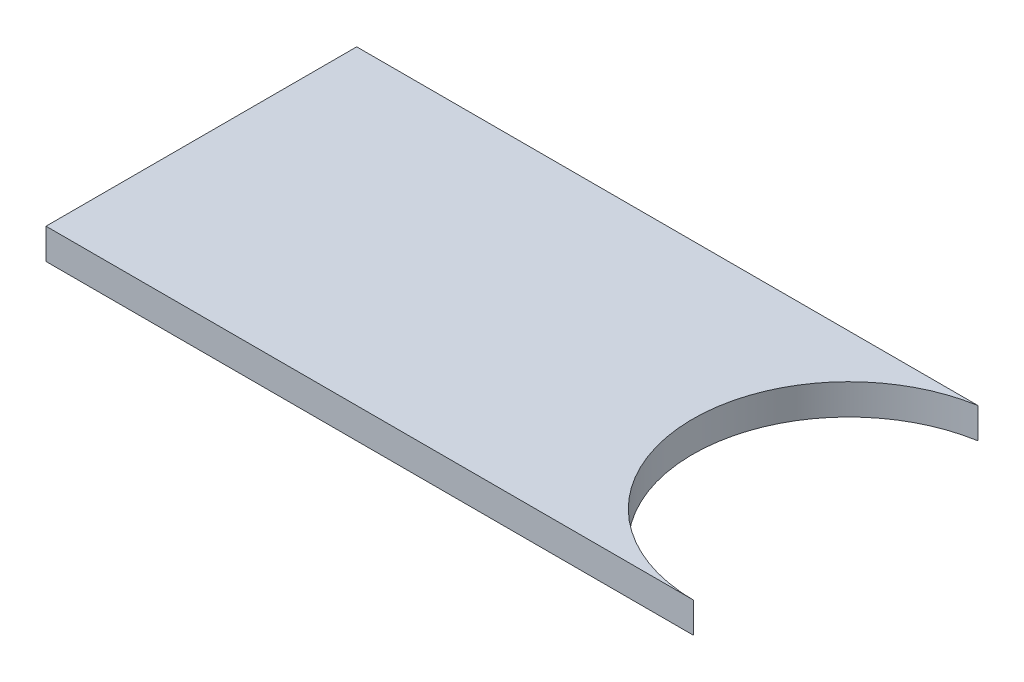
ISO-10303-21;
HEADER;
FILE_DESCRIPTION(('STEP AP214'),'2;1');
FILE_NAME('part.step','',(''),(''),'','','');
FILE_SCHEMA(('AUTOMOTIVE_DESIGN { 1 0 10303 214 1 1 1 1 }'));
ENDSEC;
DATA;
#1=APPLICATION_CONTEXT('core data for automotive mechanical design processes');
#2=APPLICATION_PROTOCOL_DEFINITION('international standard','automotive_design',2000,#1);
#3=PRODUCT_CONTEXT('',#1,'mechanical');
#4=PRODUCT('Part','Part','',(#3));
#5=PRODUCT_RELATED_PRODUCT_CATEGORY('part','',(#4));
#6=PRODUCT_DEFINITION_FORMATION('','',#4);
#7=PRODUCT_DEFINITION_CONTEXT('part definition',#1,'design');
#8=PRODUCT_DEFINITION('design','',#6,#7);
#9=PRODUCT_DEFINITION_SHAPE('','',#8);
#10=(LENGTH_UNIT() NAMED_UNIT(*) SI_UNIT(.MILLI.,.METRE.));
#11=(NAMED_UNIT(*) PLANE_ANGLE_UNIT() SI_UNIT($,.RADIAN.));
#12=(NAMED_UNIT(*) SI_UNIT($,.STERADIAN.) SOLID_ANGLE_UNIT());
#13=UNCERTAINTY_MEASURE_WITH_UNIT(LENGTH_MEASURE(1.E-05),#10,'distance_accuracy_value','');
#14=(GEOMETRIC_REPRESENTATION_CONTEXT(3) GLOBAL_UNCERTAINTY_ASSIGNED_CONTEXT((#13)) GLOBAL_UNIT_ASSIGNED_CONTEXT((#10,
#11,#12)) REPRESENTATION_CONTEXT('',''));
#15=CARTESIAN_POINT('',(0.,0.,0.));
#16=DIRECTION('',(0.,0.,1.));
#17=DIRECTION('',(1.,0.,0.));
#18=AXIS2_PLACEMENT_3D('',#15,#16,#17);
#19=CARTESIAN_POINT('',(0.,6.,0.));
#20=DIRECTION('',(-1.,0.,0.));
#21=DIRECTION('',(0.,0.,1.));
#22=AXIS2_PLACEMENT_3D('',#19,#20,#21);
#23=PLANE('',#22);
#24=DIRECTION('',(0.,0.,-1.));
#25=VECTOR('',#24,1.);
#26=CARTESIAN_POINT('',(0.,0.,0.));
#27=LINE('',#26,#25);
#28=CARTESIAN_POINT('',(0.,0.,0.));
#29=VERTEX_POINT('',#28);
#30=CARTESIAN_POINT('',(0.,0.,-60.96));
#31=VERTEX_POINT('',#30);
#32=EDGE_CURVE('E116',#29,#31,#27,.T.);
#33=ORIENTED_EDGE('',*,*,#32,.F.);
#34=DIRECTION('',(0.,-1.,0.));
#35=VECTOR('',#34,1.);
#36=CARTESIAN_POINT('',(0.,6.,0.));
#37=LINE('',#36,#35);
#38=CARTESIAN_POINT('',(0.,6.,0.));
#39=VERTEX_POINT('',#38);
#40=EDGE_CURVE('E11',#39,#29,#37,.T.);
#41=ORIENTED_EDGE('',*,*,#40,.F.);
#42=DIRECTION('',(0.,0.,-1.));
#43=VECTOR('',#42,1.);
#44=CARTESIAN_POINT('',(0.,6.,0.));
#45=LINE('',#44,#43);
#46=CARTESIAN_POINT('',(0.,6.,-60.96));
#47=VERTEX_POINT('',#46);
#48=EDGE_CURVE('E93',#39,#47,#45,.T.);
#49=ORIENTED_EDGE('',*,*,#48,.T.);
#50=DIRECTION('',(0.,-1.,0.));
#51=VECTOR('',#50,1.);
#52=CARTESIAN_POINT('',(0.,6.,-60.96));
#53=LINE('',#52,#51);
#54=EDGE_CURVE('E37',#47,#31,#53,.T.);
#55=ORIENTED_EDGE('',*,*,#54,.T.);
#56=EDGE_LOOP('',(#33,#41,#49,#55));
#57=FACE_BOUND('',#56,.T.);
#58=ADVANCED_FACE('F34',(#57),#23,.T.);
#59=CARTESIAN_POINT('',(0.,6.,0.));
#60=DIRECTION('',(0.,0.,-1.));
#61=DIRECTION('',(-1.,0.,0.));
#62=AXIS2_PLACEMENT_3D('',#59,#60,#61);
#63=PLANE('',#62);
#64=DIRECTION('',(1.,0.,0.));
#65=VECTOR('',#64,1.);
#66=CARTESIAN_POINT('',(0.,0.,0.));
#67=LINE('',#66,#65);
#68=CARTESIAN_POINT('',(127.,0.,0.));
#69=VERTEX_POINT('',#68);
#70=EDGE_CURVE('E95',#29,#69,#67,.T.);
#71=ORIENTED_EDGE('',*,*,#70,.T.);
#72=DIRECTION('',(0.,-1.,0.));
#73=VECTOR('',#72,1.);
#74=CARTESIAN_POINT('',(127.,6.,0.));
#75=LINE('',#74,#73);
#76=CARTESIAN_POINT('',(127.,6.,0.));
#77=VERTEX_POINT('',#76);
#78=EDGE_CURVE('E43',#77,#69,#75,.T.);
#79=ORIENTED_EDGE('',*,*,#78,.F.);
#80=DIRECTION('',(1.,0.,0.));
#81=VECTOR('',#80,1.);
#82=CARTESIAN_POINT('',(0.,6.,0.));
#83=LINE('',#82,#81);
#84=EDGE_CURVE('E90',#39,#77,#83,.T.);
#85=ORIENTED_EDGE('',*,*,#84,.F.);
#86=ORIENTED_EDGE('',*,*,#40,.T.);
#87=EDGE_LOOP('',(#71,#79,#85,#86));
#88=FACE_BOUND('',#87,.T.);
#89=ADVANCED_FACE('F103',(#88),#63,.F.);
#90=CARTESIAN_POINT('',(127.124122522894,6.,-30.6996846816014));
#91=DIRECTION('',(0.,1.,0.));
#92=DIRECTION('',(-0.999997160133188,0.,-0.00238321748065913));
#93=AXIS2_PLACEMENT_3D('',#90,#91,#92);
#94=ELLIPSE('',#93,30.9225604341558,30.6999349949628);
#95=DIRECTION('',(0.,-1.,0.));
#96=VECTOR('',#95,1.);
#97=SURFACE_OF_LINEAR_EXTRUSION('',#94,#96);
#98=CARTESIAN_POINT('',(127.124122522894,0.,-30.6996846816014));
#99=DIRECTION('',(0.,1.,0.));
#100=DIRECTION('',(-0.999997160133188,0.,-0.00238321748065913));
#101=AXIS2_PLACEMENT_3D('',#98,#99,#100);
#102=ELLIPSE('',#101,30.9225604341558,30.6999349949628);
#103=CARTESIAN_POINT('',(121.908718719194,0.,-60.96));
#104=VERTEX_POINT('',#103);
#105=EDGE_CURVE('E84',#104,#69,#102,.T.);
#106=ORIENTED_EDGE('',*,*,#105,.F.);
#107=DIRECTION('',(0.,-1.,0.));
#108=VECTOR('',#107,1.);
#109=CARTESIAN_POINT('',(121.908718719194,6.,-60.96));
#110=LINE('',#109,#108);
#111=CARTESIAN_POINT('',(121.908718719194,6.,-60.96));
#112=VERTEX_POINT('',#111);
#113=EDGE_CURVE('E79',#112,#104,#110,.T.);
#114=ORIENTED_EDGE('',*,*,#113,.F.);
#115=EDGE_CURVE('E82',#112,#77,#94,.T.);
#116=ORIENTED_EDGE('',*,*,#115,.T.);
#117=ORIENTED_EDGE('',*,*,#78,.T.);
#118=EDGE_LOOP('',(#106,#114,#116,#117));
#119=FACE_BOUND('',#118,.T.);
#120=ADVANCED_FACE('F81',(#119),#97,.T.);
#121=CARTESIAN_POINT('',(0.,6.,-60.96));
#122=DIRECTION('',(0.,0.,-1.));
#123=DIRECTION('',(-1.,0.,0.));
#124=AXIS2_PLACEMENT_3D('',#121,#122,#123);
#125=PLANE('',#124);
#126=DIRECTION('',(1.,0.,0.));
#127=VECTOR('',#126,1.);
#128=CARTESIAN_POINT('',(0.,0.,-60.96));
#129=LINE('',#128,#127);
#130=EDGE_CURVE('E118',#31,#104,#129,.T.);
#131=ORIENTED_EDGE('',*,*,#130,.F.);
#132=ORIENTED_EDGE('',*,*,#54,.F.);
#133=DIRECTION('',(1.,0.,0.));
#134=VECTOR('',#133,1.);
#135=CARTESIAN_POINT('',(0.,6.,-60.96));
#136=LINE('',#135,#134);
#137=EDGE_CURVE('E89',#47,#112,#136,.T.);
#138=ORIENTED_EDGE('',*,*,#137,.T.);
#139=ORIENTED_EDGE('',*,*,#113,.T.);
#140=EDGE_LOOP('',(#131,#132,#138,#139));
#141=FACE_BOUND('',#140,.T.);
#142=ADVANCED_FACE('F92',(#141),#125,.T.);
#143=CARTESIAN_POINT('',(127.124122522894,6.,-30.6996846816014));
#144=DIRECTION('',(0.,1.,0.));
#145=DIRECTION('',(0.,0.,1.));
#146=AXIS2_PLACEMENT_3D('',#143,#144,#145);
#147=PLANE('',#146);
#148=ORIENTED_EDGE('',*,*,#48,.F.);
#149=ORIENTED_EDGE('',*,*,#84,.T.);
#150=ORIENTED_EDGE('',*,*,#115,.F.);
#151=ORIENTED_EDGE('',*,*,#137,.F.);
#152=EDGE_LOOP('',(#148,#149,#150,#151));
#153=FACE_BOUND('',#152,.T.);
#154=ADVANCED_FACE('F88',(#153),#147,.T.);
#155=CARTESIAN_POINT('',(127.124122522894,0.,-30.6996846816014));
#156=DIRECTION('',(0.,1.,0.));
#157=DIRECTION('',(0.,0.,1.));
#158=AXIS2_PLACEMENT_3D('',#155,#156,#157);
#159=PLANE('',#158);
#160=ORIENTED_EDGE('',*,*,#32,.T.);
#161=ORIENTED_EDGE('',*,*,#130,.T.);
#162=ORIENTED_EDGE('',*,*,#105,.T.);
#163=ORIENTED_EDGE('',*,*,#70,.F.);
#164=EDGE_LOOP('',(#160,#161,#162,#163));
#165=FACE_BOUND('',#164,.T.);
#166=ADVANCED_FACE('F109',(#165),#159,.F.);
#167=CLOSED_SHELL('',(#58,#89,#120,#142,#154,#166));
#168=MANIFOLD_SOLID_BREP('B2',#167);
#169=ADVANCED_BREP_SHAPE_REPRESENTATION('',(#18,#168),#14);
#170=SHAPE_DEFINITION_REPRESENTATION(#9,#169);
ENDSEC;
END-ISO-10303-21;
